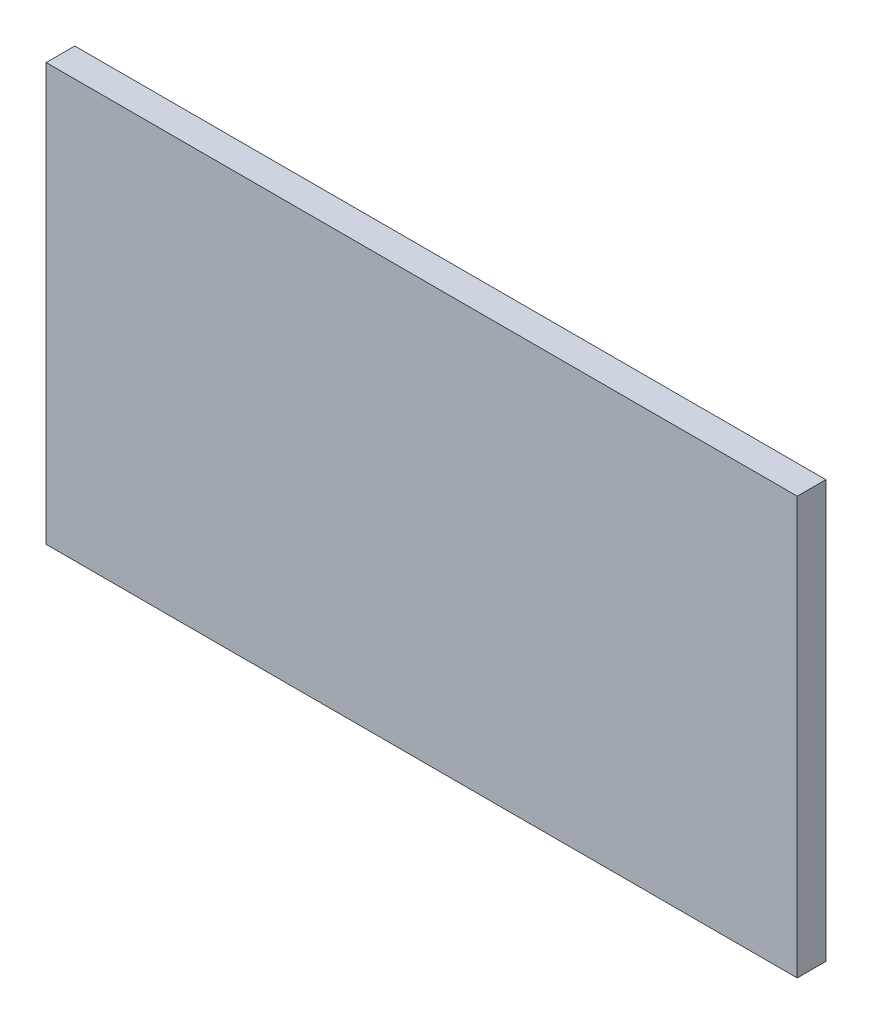
ISO-10303-21;
HEADER;
FILE_DESCRIPTION(('STEP AP214'),'2;1');
FILE_NAME('part.step','',(''),(''),'','','');
FILE_SCHEMA(('AUTOMOTIVE_DESIGN { 1 0 10303 214 1 1 1 1 }'));
ENDSEC;
DATA;
#1=APPLICATION_CONTEXT('core data for automotive mechanical design processes');
#2=APPLICATION_PROTOCOL_DEFINITION('international standard','automotive_design',2000,#1);
#3=PRODUCT_CONTEXT('',#1,'mechanical');
#4=PRODUCT('Part','Part','',(#3));
#5=PRODUCT_RELATED_PRODUCT_CATEGORY('part','',(#4));
#6=PRODUCT_DEFINITION_FORMATION('','',#4);
#7=PRODUCT_DEFINITION_CONTEXT('part definition',#1,'design');
#8=PRODUCT_DEFINITION('design','',#6,#7);
#9=PRODUCT_DEFINITION_SHAPE('','',#8);
#10=(LENGTH_UNIT() NAMED_UNIT(*) SI_UNIT(.MILLI.,.METRE.));
#11=(NAMED_UNIT(*) PLANE_ANGLE_UNIT() SI_UNIT($,.RADIAN.));
#12=(NAMED_UNIT(*) SI_UNIT($,.STERADIAN.) SOLID_ANGLE_UNIT());
#13=UNCERTAINTY_MEASURE_WITH_UNIT(LENGTH_MEASURE(1.E-05),#10,'distance_accuracy_value','');
#14=(GEOMETRIC_REPRESENTATION_CONTEXT(3) GLOBAL_UNCERTAINTY_ASSIGNED_CONTEXT((#13)) GLOBAL_UNIT_ASSIGNED_CONTEXT((#10,
#11,#12)) REPRESENTATION_CONTEXT('',''));
#15=CARTESIAN_POINT('',(0.,0.,0.));
#16=DIRECTION('',(0.,0.,1.));
#17=DIRECTION('',(1.,0.,0.));
#18=AXIS2_PLACEMENT_3D('',#15,#16,#17);
#19=CARTESIAN_POINT('',(0.70008,4.8,0.));
#20=DIRECTION('',(0.,0.,-1.));
#21=DIRECTION('',(-1.,0.,0.));
#22=AXIS2_PLACEMENT_3D('',#19,#20,#21);
#23=PLANE('',#22);
#24=DIRECTION('',(1.,0.,0.));
#25=VECTOR('',#24,1.);
#26=CARTESIAN_POINT('',(0.25008,5.05,0.));
#27=LINE('',#26,#25);
#28=CARTESIAN_POINT('',(0.25008,5.05,0.));
#29=VERTEX_POINT('',#28);
#30=CARTESIAN_POINT('',(1.15008,5.05,0.));
#31=VERTEX_POINT('',#30);
#32=EDGE_CURVE('E55',#29,#31,#27,.T.);
#33=ORIENTED_EDGE('',*,*,#32,.T.);
#34=DIRECTION('',(0.,1.,0.));
#35=VECTOR('',#34,1.);
#36=CARTESIAN_POINT('',(1.15008,5.05,0.));
#37=LINE('',#36,#35);
#38=CARTESIAN_POINT('',(1.15008,4.55,0.));
#39=VERTEX_POINT('',#38);
#40=EDGE_CURVE('E57',#31,#39,#37,.F.);
#41=ORIENTED_EDGE('',*,*,#40,.T.);
#42=DIRECTION('',(1.,0.,0.));
#43=VECTOR('',#42,1.);
#44=CARTESIAN_POINT('',(1.15008,4.55,0.));
#45=LINE('',#44,#43);
#46=CARTESIAN_POINT('',(0.25008,4.55,0.));
#47=VERTEX_POINT('',#46);
#48=EDGE_CURVE('E20',#39,#47,#45,.F.);
#49=ORIENTED_EDGE('',*,*,#48,.T.);
#50=DIRECTION('',(0.,1.,0.));
#51=VECTOR('',#50,1.);
#52=CARTESIAN_POINT('',(0.25008,4.55,0.));
#53=LINE('',#52,#51);
#54=EDGE_CURVE('E80',#47,#29,#53,.T.);
#55=ORIENTED_EDGE('',*,*,#54,.T.);
#56=EDGE_LOOP('',(#33,#41,#49,#55));
#57=FACE_BOUND('',#56,.T.);
#58=ADVANCED_FACE('F17',(#57),#23,.T.);
#59=CARTESIAN_POINT('',(1.15008,4.55,0.));
#60=DIRECTION('',(0.,1.,0.));
#61=DIRECTION('',(0.,0.,1.));
#62=AXIS2_PLACEMENT_3D('',#59,#60,#61);
#63=PLANE('',#62);
#64=DIRECTION('',(0.,0.,-1.));
#65=VECTOR('',#64,1.);
#66=CARTESIAN_POINT('',(0.25008,4.55,0.));
#67=LINE('',#66,#65);
#68=CARTESIAN_POINT('',(0.25008,4.55,0.03429));
#69=VERTEX_POINT('',#68);
#70=EDGE_CURVE('E68',#69,#47,#67,.T.);
#71=ORIENTED_EDGE('',*,*,#70,.T.);
#72=ORIENTED_EDGE('',*,*,#48,.F.);
#73=DIRECTION('',(0.,0.,1.));
#74=VECTOR('',#73,1.);
#75=CARTESIAN_POINT('',(1.15008,4.55,0.));
#76=LINE('',#75,#74);
#77=CARTESIAN_POINT('',(1.15008,4.55,0.03429));
#78=VERTEX_POINT('',#77);
#79=EDGE_CURVE('E63',#39,#78,#76,.T.);
#80=ORIENTED_EDGE('',*,*,#79,.T.);
#81=DIRECTION('',(1.,0.,0.));
#82=VECTOR('',#81,1.);
#83=CARTESIAN_POINT('',(0.70008,4.55,0.03429));
#84=LINE('',#83,#82);
#85=EDGE_CURVE('E83',#69,#78,#84,.T.);
#86=ORIENTED_EDGE('',*,*,#85,.F.);
#87=EDGE_LOOP('',(#71,#72,#80,#86));
#88=FACE_BOUND('',#87,.T.);
#89=ADVANCED_FACE('F65',(#88),#63,.F.);
#90=CARTESIAN_POINT('',(1.15008,5.05,0.));
#91=DIRECTION('',(-1.,0.,0.));
#92=DIRECTION('',(0.,0.,1.));
#93=AXIS2_PLACEMENT_3D('',#90,#91,#92);
#94=PLANE('',#93);
#95=ORIENTED_EDGE('',*,*,#79,.F.);
#96=ORIENTED_EDGE('',*,*,#40,.F.);
#97=DIRECTION('',(0.,0.,-1.));
#98=VECTOR('',#97,1.);
#99=CARTESIAN_POINT('',(1.15008,5.05,0.));
#100=LINE('',#99,#98);
#101=CARTESIAN_POINT('',(1.15008,5.05,0.03429));
#102=VERTEX_POINT('',#101);
#103=EDGE_CURVE('E75',#31,#102,#100,.F.);
#104=ORIENTED_EDGE('',*,*,#103,.T.);
#105=DIRECTION('',(0.,1.,0.));
#106=VECTOR('',#105,1.);
#107=CARTESIAN_POINT('',(1.15008,4.8,0.03429));
#108=LINE('',#107,#106);
#109=EDGE_CURVE('E72',#78,#102,#108,.T.);
#110=ORIENTED_EDGE('',*,*,#109,.F.);
#111=EDGE_LOOP('',(#95,#96,#104,#110));
#112=FACE_BOUND('',#111,.T.);
#113=ADVANCED_FACE('F70',(#112),#94,.F.);
#114=CARTESIAN_POINT('',(0.25008,5.05,0.));
#115=DIRECTION('',(0.,-1.,0.));
#116=DIRECTION('',(0.,0.,-1.));
#117=AXIS2_PLACEMENT_3D('',#114,#115,#116);
#118=PLANE('',#117);
#119=ORIENTED_EDGE('',*,*,#103,.F.);
#120=ORIENTED_EDGE('',*,*,#32,.F.);
#121=DIRECTION('',(0.,0.,-1.));
#122=VECTOR('',#121,1.);
#123=CARTESIAN_POINT('',(0.25008,5.05,0.));
#124=LINE('',#123,#122);
#125=CARTESIAN_POINT('',(0.25008,5.05,0.03429));
#126=VERTEX_POINT('',#125);
#127=EDGE_CURVE('E35',#29,#126,#124,.F.);
#128=ORIENTED_EDGE('',*,*,#127,.T.);
#129=DIRECTION('',(1.,0.,0.));
#130=VECTOR('',#129,1.);
#131=CARTESIAN_POINT('',(0.70008,5.05,0.03429));
#132=LINE('',#131,#130);
#133=EDGE_CURVE('E26',#102,#126,#132,.F.);
#134=ORIENTED_EDGE('',*,*,#133,.F.);
#135=EDGE_LOOP('',(#119,#120,#128,#134));
#136=FACE_BOUND('',#135,.T.);
#137=ADVANCED_FACE('F89',(#136),#118,.F.);
#138=CARTESIAN_POINT('',(0.25008,4.55,0.));
#139=DIRECTION('',(1.,0.,0.));
#140=DIRECTION('',(0.,0.,-1.));
#141=AXIS2_PLACEMENT_3D('',#138,#139,#140);
#142=PLANE('',#141);
#143=ORIENTED_EDGE('',*,*,#127,.F.);
#144=ORIENTED_EDGE('',*,*,#54,.F.);
#145=ORIENTED_EDGE('',*,*,#70,.F.);
#146=DIRECTION('',(0.,1.,0.));
#147=VECTOR('',#146,1.);
#148=CARTESIAN_POINT('',(0.25008,4.8,0.03429));
#149=LINE('',#148,#147);
#150=EDGE_CURVE('E11',#126,#69,#149,.F.);
#151=ORIENTED_EDGE('',*,*,#150,.F.);
#152=EDGE_LOOP('',(#143,#144,#145,#151));
#153=FACE_BOUND('',#152,.T.);
#154=ADVANCED_FACE('F91',(#153),#142,.F.);
#155=CARTESIAN_POINT('',(0.70008,4.8,0.03429));
#156=DIRECTION('',(0.,0.,1.));
#157=DIRECTION('',(1.,0.,0.));
#158=AXIS2_PLACEMENT_3D('',#155,#156,#157);
#159=PLANE('',#158);
#160=ORIENTED_EDGE('',*,*,#133,.T.);
#161=ORIENTED_EDGE('',*,*,#150,.T.);
#162=ORIENTED_EDGE('',*,*,#85,.T.);
#163=ORIENTED_EDGE('',*,*,#109,.T.);
#164=EDGE_LOOP('',(#160,#161,#162,#163));
#165=FACE_BOUND('',#164,.T.);
#166=ADVANCED_FACE('F88',(#165),#159,.T.);
#167=CLOSED_SHELL('',(#58,#89,#113,#137,#154,#166));
#168=MANIFOLD_SOLID_BREP('B1',#167);
#169=ADVANCED_BREP_SHAPE_REPRESENTATION('',(#18,#168),#14);
#170=SHAPE_DEFINITION_REPRESENTATION(#9,#169);
ENDSEC;
END-ISO-10303-21;
